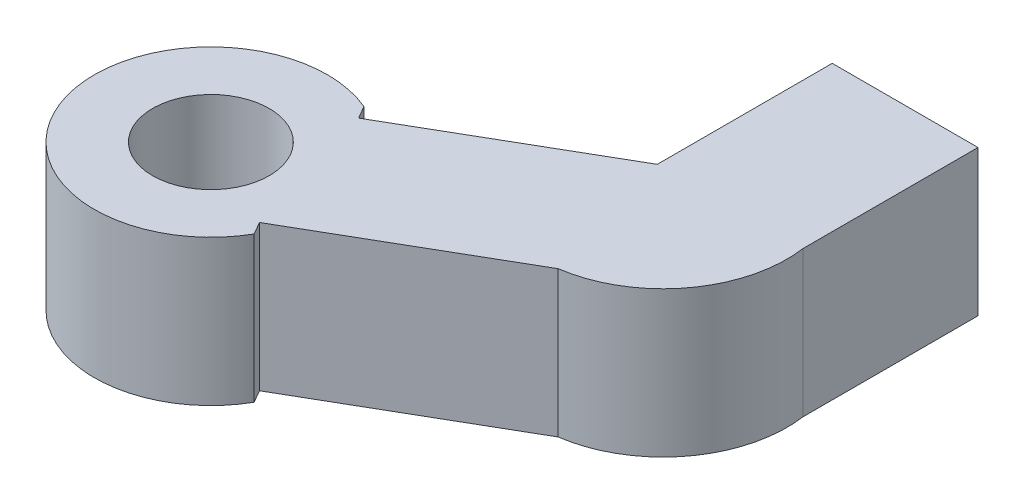
ISO-10303-21;
HEADER;
FILE_DESCRIPTION(('STEP AP214'),'2;1');
FILE_NAME('part.step','',(''),(''),'','','');
FILE_SCHEMA(('AUTOMOTIVE_DESIGN { 1 0 10303 214 1 1 1 1 }'));
ENDSEC;
DATA;
#1=APPLICATION_CONTEXT('core data for automotive mechanical design processes');
#2=APPLICATION_PROTOCOL_DEFINITION('international standard','automotive_design',2000,#1);
#3=PRODUCT_CONTEXT('',#1,'mechanical');
#4=PRODUCT('Part','Part','',(#3));
#5=PRODUCT_RELATED_PRODUCT_CATEGORY('part','',(#4));
#6=PRODUCT_DEFINITION_FORMATION('','',#4);
#7=PRODUCT_DEFINITION_CONTEXT('part definition',#1,'design');
#8=PRODUCT_DEFINITION('design','',#6,#7);
#9=PRODUCT_DEFINITION_SHAPE('','',#8);
#10=(LENGTH_UNIT() NAMED_UNIT(*) SI_UNIT(.MILLI.,.METRE.));
#11=(NAMED_UNIT(*) PLANE_ANGLE_UNIT() SI_UNIT($,.RADIAN.));
#12=(NAMED_UNIT(*) SI_UNIT($,.STERADIAN.) SOLID_ANGLE_UNIT());
#13=UNCERTAINTY_MEASURE_WITH_UNIT(LENGTH_MEASURE(1.E-05),#10,'distance_accuracy_value','');
#14=(GEOMETRIC_REPRESENTATION_CONTEXT(3) GLOBAL_UNCERTAINTY_ASSIGNED_CONTEXT((#13)) GLOBAL_UNIT_ASSIGNED_CONTEXT((#10,
#11,#12)) REPRESENTATION_CONTEXT('',''));
#15=CARTESIAN_POINT('',(0.,0.,0.));
#16=DIRECTION('',(0.,0.,1.));
#17=DIRECTION('',(1.,0.,0.));
#18=AXIS2_PLACEMENT_3D('',#15,#16,#17);
#19=CARTESIAN_POINT('',(0.791681084241543,2.5,0.593760813181156));
#20=DIRECTION('',(0.,1.,0.));
#21=DIRECTION('',(0.,0.,1.));
#22=AXIS2_PLACEMENT_3D('',#19,#20,#21);
#23=PLANE('',#22);
#24=DIRECTION('',(0.,0.,1.));
#25=VECTOR('',#24,1.);
#26=CARTESIAN_POINT('',(0.,2.5,0.));
#27=LINE('',#26,#25);
#28=CARTESIAN_POINT('',(0.,2.5,-6.));
#29=VERTEX_POINT('',#28);
#30=CARTESIAN_POINT('',(0.,2.5,0.));
#31=VERTEX_POINT('',#30);
#32=EDGE_CURVE('E177',#29,#31,#27,.T.);
#33=ORIENTED_EDGE('',*,*,#32,.T.);
#34=DIRECTION('',(-0.866025403784436,0.,0.500000000000004));
#35=VECTOR('',#34,1.);
#36=CARTESIAN_POINT('',(0.,2.5,0.));
#37=LINE('',#36,#35);
#38=CARTESIAN_POINT('',(-6.49519052838327,2.5,3.75000000000003));
#39=VERTEX_POINT('',#38);
#40=EDGE_CURVE('E107',#31,#39,#37,.T.);
#41=ORIENTED_EDGE('',*,*,#40,.T.);
#42=DIRECTION('',(-0.500000000000004,0.,-0.866025403784437));
#43=VECTOR('',#42,1.);
#44=CARTESIAN_POINT('',(-6.49519052838327,2.5,3.75000000000003));
#45=LINE('',#44,#43);
#46=CARTESIAN_POINT('',(-6.74519052838327,2.5,3.31698729810781));
#47=VERTEX_POINT('',#46);
#48=EDGE_CURVE('E202',#39,#47,#45,.T.);
#49=ORIENTED_EDGE('',*,*,#48,.T.);
#50=CARTESIAN_POINT('',(-8.31644795723708,2.5,6.99545846046205));
#51=DIRECTION('',(0.,1.,0.));
#52=DIRECTION('',(0.,0.,1.));
#53=AXIS2_PLACEMENT_3D('',#50,#51,#52);
#54=CIRCLE('',#53,4.);
#55=CARTESIAN_POINT('',(-4.84519052838327,2.5,8.98301270189225));
#56=VERTEX_POINT('',#55);
#57=EDGE_CURVE('E220',#47,#56,#54,.T.);
#58=ORIENTED_EDGE('',*,*,#57,.T.);
#59=DIRECTION('',(-0.500000000000003,0.,-0.866025403784437));
#60=VECTOR('',#59,1.);
#61=CARTESIAN_POINT('',(-5.09519052838327,2.5,8.55000000000003));
#62=LINE('',#61,#60);
#63=CARTESIAN_POINT('',(-5.09519052838327,2.5,8.55000000000003));
#64=VERTEX_POINT('',#63);
#65=EDGE_CURVE('E218',#56,#64,#62,.T.);
#66=ORIENTED_EDGE('',*,*,#65,.T.);
#67=DIRECTION('',(0.866025403784437,0.,-0.500000000000004));
#68=VECTOR('',#67,1.);
#69=CARTESIAN_POINT('',(1.40000000000002,2.5,4.8));
#70=LINE('',#69,#68);
#71=CARTESIAN_POINT('',(1.40000000000002,2.5,4.8));
#72=VERTEX_POINT('',#71);
#73=EDGE_CURVE('E129',#64,#72,#70,.T.);
#74=ORIENTED_EDGE('',*,*,#73,.T.);
#75=CARTESIAN_POINT('',(0.791681084241543,2.5,0.593760813181156));
#76=DIRECTION('',(0.,1.,0.));
#77=DIRECTION('',(0.,0.,1.));
#78=AXIS2_PLACEMENT_3D('',#75,#76,#77);
#79=CIRCLE('',#78,4.25);
#80=CARTESIAN_POINT('',(5.,2.5,0.));
#81=VERTEX_POINT('',#80);
#82=EDGE_CURVE('E123',#72,#81,#79,.T.);
#83=ORIENTED_EDGE('',*,*,#82,.T.);
#84=DIRECTION('',(0.,0.,-1.));
#85=VECTOR('',#84,1.);
#86=CARTESIAN_POINT('',(5.,2.5,0.));
#87=LINE('',#86,#85);
#88=CARTESIAN_POINT('',(5.,2.5,-6.));
#89=VERTEX_POINT('',#88);
#90=EDGE_CURVE('E127',#81,#89,#87,.T.);
#91=ORIENTED_EDGE('',*,*,#90,.T.);
#92=DIRECTION('',(-1.,0.,0.));
#93=VECTOR('',#92,1.);
#94=CARTESIAN_POINT('',(0.,2.5,-6.));
#95=LINE('',#94,#93);
#96=EDGE_CURVE('E61',#89,#29,#95,.T.);
#97=ORIENTED_EDGE('',*,*,#96,.T.);
#98=EDGE_LOOP('',(#33,#41,#49,#58,#66,#74,#83,#91,#97));
#99=FACE_BOUND('',#98,.T.);
#100=CARTESIAN_POINT('',(-8.31644795723708,2.5,6.99545846046205));
#101=DIRECTION('',(0.,1.,0.));
#102=DIRECTION('',(0.,0.,1.));
#103=AXIS2_PLACEMENT_3D('',#100,#101,#102);
#104=CIRCLE('',#103,2.);
#105=CARTESIAN_POINT('',(-8.31644795723708,2.5,8.99545846046205));
#106=VERTEX_POINT('',#105);
#107=EDGE_CURVE('E156',#106,#106,#104,.T.);
#108=ORIENTED_EDGE('',*,*,#107,.F.);
#109=EDGE_LOOP('',(#108));
#110=FACE_BOUND('',#109,.T.);
#111=ADVANCED_FACE('F43',(#99,#110),#23,.T.);
#112=CARTESIAN_POINT('',(0.791681084241543,-2.5,0.593760813181156));
#113=DIRECTION('',(0.,1.,0.));
#114=DIRECTION('',(0.,0.,1.));
#115=AXIS2_PLACEMENT_3D('',#112,#113,#114);
#116=PLANE('',#115);
#117=DIRECTION('',(0.,0.,1.));
#118=VECTOR('',#117,1.);
#119=CARTESIAN_POINT('',(0.,-2.5,0.));
#120=LINE('',#119,#118);
#121=CARTESIAN_POINT('',(0.,-2.5,-6.));
#122=VERTEX_POINT('',#121);
#123=CARTESIAN_POINT('',(0.,-2.5,0.));
#124=VERTEX_POINT('',#123);
#125=EDGE_CURVE('E151',#122,#124,#120,.T.);
#126=ORIENTED_EDGE('',*,*,#125,.F.);
#127=DIRECTION('',(-1.,0.,0.));
#128=VECTOR('',#127,1.);
#129=CARTESIAN_POINT('',(0.,-2.5,-6.));
#130=LINE('',#129,#128);
#131=CARTESIAN_POINT('',(5.,-2.5,-6.));
#132=VERTEX_POINT('',#131);
#133=EDGE_CURVE('E99',#132,#122,#130,.T.);
#134=ORIENTED_EDGE('',*,*,#133,.F.);
#135=DIRECTION('',(0.,0.,-1.));
#136=VECTOR('',#135,1.);
#137=CARTESIAN_POINT('',(5.,-2.5,0.));
#138=LINE('',#137,#136);
#139=CARTESIAN_POINT('',(5.,-2.5,0.));
#140=VERTEX_POINT('',#139);
#141=EDGE_CURVE('E93',#140,#132,#138,.T.);
#142=ORIENTED_EDGE('',*,*,#141,.F.);
#143=CARTESIAN_POINT('',(0.791681084241543,-2.5,0.593760813181156));
#144=DIRECTION('',(0.,1.,0.));
#145=DIRECTION('',(0.,0.,1.));
#146=AXIS2_PLACEMENT_3D('',#143,#144,#145);
#147=CIRCLE('',#146,4.25);
#148=CARTESIAN_POINT('',(1.40000000000002,-2.5,4.8));
#149=VERTEX_POINT('',#148);
#150=EDGE_CURVE('E138',#149,#140,#147,.T.);
#151=ORIENTED_EDGE('',*,*,#150,.F.);
#152=DIRECTION('',(0.866025403784437,0.,-0.500000000000004));
#153=VECTOR('',#152,1.);
#154=CARTESIAN_POINT('',(1.40000000000002,-2.5,4.8));
#155=LINE('',#154,#153);
#156=CARTESIAN_POINT('',(-5.09519052838327,-2.5,8.55000000000003));
#157=VERTEX_POINT('',#156);
#158=EDGE_CURVE('E168',#157,#149,#155,.T.);
#159=ORIENTED_EDGE('',*,*,#158,.F.);
#160=DIRECTION('',(-0.500000000000003,0.,-0.866025403784437));
#161=VECTOR('',#160,1.);
#162=CARTESIAN_POINT('',(-5.09519052838327,-2.5,8.55000000000003));
#163=LINE('',#162,#161);
#164=CARTESIAN_POINT('',(-4.84519052838327,-2.5,8.98301270189225));
#165=VERTEX_POINT('',#164);
#166=EDGE_CURVE('E165',#165,#157,#163,.T.);
#167=ORIENTED_EDGE('',*,*,#166,.F.);
#168=CARTESIAN_POINT('',(-8.31644795723708,-2.5,6.99545846046205));
#169=DIRECTION('',(0.,1.,0.));
#170=DIRECTION('',(0.,0.,1.));
#171=AXIS2_PLACEMENT_3D('',#168,#169,#170);
#172=CIRCLE('',#171,4.);
#173=CARTESIAN_POINT('',(-6.74519052838327,-2.5,3.31698729810781));
#174=VERTEX_POINT('',#173);
#175=EDGE_CURVE('E162',#174,#165,#172,.T.);
#176=ORIENTED_EDGE('',*,*,#175,.F.);
#177=DIRECTION('',(-0.500000000000004,0.,-0.866025403784437));
#178=VECTOR('',#177,1.);
#179=CARTESIAN_POINT('',(-6.49519052838327,-2.5,3.75000000000003));
#180=LINE('',#179,#178);
#181=CARTESIAN_POINT('',(-6.49519052838327,-2.5,3.75000000000003));
#182=VERTEX_POINT('',#181);
#183=EDGE_CURVE('E159',#182,#174,#180,.T.);
#184=ORIENTED_EDGE('',*,*,#183,.F.);
#185=DIRECTION('',(-0.866025403784436,0.,0.500000000000004));
#186=VECTOR('',#185,1.);
#187=CARTESIAN_POINT('',(0.,-2.5,0.));
#188=LINE('',#187,#186);
#189=EDGE_CURVE('E155',#124,#182,#188,.T.);
#190=ORIENTED_EDGE('',*,*,#189,.F.);
#191=EDGE_LOOP('',(#126,#134,#142,#151,#159,#167,#176,#184,#190));
#192=FACE_BOUND('',#191,.T.);
#193=CARTESIAN_POINT('',(-8.31644795723708,-2.5,6.99545846046205));
#194=DIRECTION('',(0.,1.,0.));
#195=DIRECTION('',(0.,0.,1.));
#196=AXIS2_PLACEMENT_3D('',#193,#194,#195);
#197=CIRCLE('',#196,2.);
#198=CARTESIAN_POINT('',(-8.31644795723708,-2.5,8.99545846046205));
#199=VERTEX_POINT('',#198);
#200=EDGE_CURVE('E232',#199,#199,#197,.T.);
#201=ORIENTED_EDGE('',*,*,#200,.T.);
#202=EDGE_LOOP('',(#201));
#203=FACE_BOUND('',#202,.T.);
#204=ADVANCED_FACE('F206',(#192,#203),#116,.F.);
#205=CARTESIAN_POINT('',(0.,2.5,0.));
#206=DIRECTION('',(1.,0.,0.));
#207=DIRECTION('',(0.,0.,-1.));
#208=AXIS2_PLACEMENT_3D('',#205,#206,#207);
#209=PLANE('',#208);
#210=ORIENTED_EDGE('',*,*,#125,.T.);
#211=DIRECTION('',(0.,-1.,0.));
#212=VECTOR('',#211,1.);
#213=CARTESIAN_POINT('',(0.,2.5,0.));
#214=LINE('',#213,#212);
#215=EDGE_CURVE('E11',#31,#124,#214,.T.);
#216=ORIENTED_EDGE('',*,*,#215,.F.);
#217=ORIENTED_EDGE('',*,*,#32,.F.);
#218=DIRECTION('',(0.,-1.,0.));
#219=VECTOR('',#218,1.);
#220=CARTESIAN_POINT('',(0.,2.5,-6.));
#221=LINE('',#220,#219);
#222=EDGE_CURVE('E147',#29,#122,#221,.T.);
#223=ORIENTED_EDGE('',*,*,#222,.T.);
#224=EDGE_LOOP('',(#210,#216,#217,#223));
#225=FACE_BOUND('',#224,.T.);
#226=ADVANCED_FACE('F45',(#225),#209,.F.);
#227=CARTESIAN_POINT('',(0.,2.5,0.));
#228=DIRECTION('',(0.500000000000004,0.,0.866025403784436));
#229=DIRECTION('',(0.866025403784436,0.,-0.500000000000004));
#230=AXIS2_PLACEMENT_3D('',#227,#228,#229);
#231=PLANE('',#230);
#232=ORIENTED_EDGE('',*,*,#189,.T.);
#233=DIRECTION('',(0.,-1.,0.));
#234=VECTOR('',#233,1.);
#235=CARTESIAN_POINT('',(-6.49519052838327,2.5,3.75000000000003));
#236=LINE('',#235,#234);
#237=EDGE_CURVE('E53',#39,#182,#236,.T.);
#238=ORIENTED_EDGE('',*,*,#237,.F.);
#239=ORIENTED_EDGE('',*,*,#40,.F.);
#240=ORIENTED_EDGE('',*,*,#215,.T.);
#241=EDGE_LOOP('',(#232,#238,#239,#240));
#242=FACE_BOUND('',#241,.T.);
#243=ADVANCED_FACE('F266',(#242),#231,.F.);
#244=CARTESIAN_POINT('',(-6.49519052838327,2.5,3.75000000000003));
#245=DIRECTION('',(-0.866025403784437,0.,0.500000000000004));
#246=DIRECTION('',(0.500000000000004,0.,0.866025403784437));
#247=AXIS2_PLACEMENT_3D('',#244,#245,#246);
#248=PLANE('',#247);
#249=ORIENTED_EDGE('',*,*,#183,.T.);
#250=DIRECTION('',(0.,-1.,0.));
#251=VECTOR('',#250,1.);
#252=CARTESIAN_POINT('',(-6.74519052838327,2.5,3.31698729810781));
#253=LINE('',#252,#251);
#254=EDGE_CURVE('E192',#47,#174,#253,.T.);
#255=ORIENTED_EDGE('',*,*,#254,.F.);
#256=ORIENTED_EDGE('',*,*,#48,.F.);
#257=ORIENTED_EDGE('',*,*,#237,.T.);
#258=EDGE_LOOP('',(#249,#255,#256,#257));
#259=FACE_BOUND('',#258,.T.);
#260=ADVANCED_FACE('F200',(#259),#248,.F.);
#261=CARTESIAN_POINT('',(-8.31644795723708,2.5,6.99545846046205));
#262=DIRECTION('',(0.,-1.,0.));
#263=DIRECTION('',(0.,0.,-1.));
#264=AXIS2_PLACEMENT_3D('',#261,#262,#263);
#265=CYLINDRICAL_SURFACE('',#264,4.);
#266=ORIENTED_EDGE('',*,*,#175,.T.);
#267=DIRECTION('',(0.,-1.,0.));
#268=VECTOR('',#267,1.);
#269=CARTESIAN_POINT('',(-4.84519052838327,2.5,8.98301270189225));
#270=LINE('',#269,#268);
#271=EDGE_CURVE('E188',#56,#165,#270,.T.);
#272=ORIENTED_EDGE('',*,*,#271,.F.);
#273=ORIENTED_EDGE('',*,*,#57,.F.);
#274=ORIENTED_EDGE('',*,*,#254,.T.);
#275=EDGE_LOOP('',(#266,#272,#273,#274));
#276=FACE_BOUND('',#275,.T.);
#277=ADVANCED_FACE('F212',(#276),#265,.T.);
#278=CARTESIAN_POINT('',(-5.09519052838327,2.5,8.55000000000003));
#279=DIRECTION('',(-0.866025403784437,0.,0.500000000000003));
#280=DIRECTION('',(0.500000000000003,0.,0.866025403784437));
#281=AXIS2_PLACEMENT_3D('',#278,#279,#280);
#282=PLANE('',#281);
#283=ORIENTED_EDGE('',*,*,#166,.T.);
#284=DIRECTION('',(0.,-1.,0.));
#285=VECTOR('',#284,1.);
#286=CARTESIAN_POINT('',(-5.09519052838327,2.5,8.55000000000003));
#287=LINE('',#286,#285);
#288=EDGE_CURVE('E184',#64,#157,#287,.T.);
#289=ORIENTED_EDGE('',*,*,#288,.F.);
#290=ORIENTED_EDGE('',*,*,#65,.F.);
#291=ORIENTED_EDGE('',*,*,#271,.T.);
#292=EDGE_LOOP('',(#283,#289,#290,#291));
#293=FACE_BOUND('',#292,.T.);
#294=ADVANCED_FACE('F216',(#293),#282,.F.);
#295=CARTESIAN_POINT('',(1.40000000000002,2.5,4.8));
#296=DIRECTION('',(-0.500000000000004,0.,-0.866025403784437));
#297=DIRECTION('',(-0.866025403784437,0.,0.500000000000004));
#298=AXIS2_PLACEMENT_3D('',#295,#296,#297);
#299=PLANE('',#298);
#300=ORIENTED_EDGE('',*,*,#158,.T.);
#301=DIRECTION('',(0.,-1.,0.));
#302=VECTOR('',#301,1.);
#303=CARTESIAN_POINT('',(1.40000000000002,2.5,4.8));
#304=LINE('',#303,#302);
#305=EDGE_CURVE('E140',#72,#149,#304,.T.);
#306=ORIENTED_EDGE('',*,*,#305,.F.);
#307=ORIENTED_EDGE('',*,*,#73,.F.);
#308=ORIENTED_EDGE('',*,*,#288,.T.);
#309=EDGE_LOOP('',(#300,#306,#307,#308));
#310=FACE_BOUND('',#309,.T.);
#311=ADVANCED_FACE('F257',(#310),#299,.F.);
#312=CARTESIAN_POINT('',(0.791681084241543,2.5,0.593760813181156));
#313=DIRECTION('',(0.,-1.,0.));
#314=DIRECTION('',(0.,0.,-1.));
#315=AXIS2_PLACEMENT_3D('',#312,#313,#314);
#316=CYLINDRICAL_SURFACE('',#315,4.25);
#317=ORIENTED_EDGE('',*,*,#150,.T.);
#318=DIRECTION('',(0.,-1.,0.));
#319=VECTOR('',#318,1.);
#320=CARTESIAN_POINT('',(5.,2.5,0.));
#321=LINE('',#320,#319);
#322=EDGE_CURVE('E135',#81,#140,#321,.T.);
#323=ORIENTED_EDGE('',*,*,#322,.F.);
#324=ORIENTED_EDGE('',*,*,#82,.F.);
#325=ORIENTED_EDGE('',*,*,#305,.T.);
#326=EDGE_LOOP('',(#317,#323,#324,#325));
#327=FACE_BOUND('',#326,.T.);
#328=ADVANCED_FACE('F136',(#327),#316,.T.);
#329=CARTESIAN_POINT('',(5.,2.5,0.));
#330=DIRECTION('',(-1.,0.,0.));
#331=DIRECTION('',(0.,0.,1.));
#332=AXIS2_PLACEMENT_3D('',#329,#330,#331);
#333=PLANE('',#332);
#334=ORIENTED_EDGE('',*,*,#141,.T.);
#335=DIRECTION('',(0.,-1.,0.));
#336=VECTOR('',#335,1.);
#337=CARTESIAN_POINT('',(5.,2.5,-6.));
#338=LINE('',#337,#336);
#339=EDGE_CURVE('E141',#89,#132,#338,.T.);
#340=ORIENTED_EDGE('',*,*,#339,.F.);
#341=ORIENTED_EDGE('',*,*,#90,.F.);
#342=ORIENTED_EDGE('',*,*,#322,.T.);
#343=EDGE_LOOP('',(#334,#340,#341,#342));
#344=FACE_BOUND('',#343,.T.);
#345=ADVANCED_FACE('F143',(#344),#333,.F.);
#346=CARTESIAN_POINT('',(0.,2.5,-6.));
#347=DIRECTION('',(0.,0.,1.));
#348=DIRECTION('',(1.,0.,0.));
#349=AXIS2_PLACEMENT_3D('',#346,#347,#348);
#350=PLANE('',#349);
#351=ORIENTED_EDGE('',*,*,#133,.T.);
#352=ORIENTED_EDGE('',*,*,#222,.F.);
#353=ORIENTED_EDGE('',*,*,#96,.F.);
#354=ORIENTED_EDGE('',*,*,#339,.T.);
#355=EDGE_LOOP('',(#351,#352,#353,#354));
#356=FACE_BOUND('',#355,.T.);
#357=ADVANCED_FACE('F250',(#356),#350,.F.);
#358=CARTESIAN_POINT('',(-8.31644795723708,2.5,6.99545846046205));
#359=DIRECTION('',(0.,-1.,0.));
#360=DIRECTION('',(0.,0.,-1.));
#361=AXIS2_PLACEMENT_3D('',#358,#359,#360);
#362=CYLINDRICAL_SURFACE('',#361,2.);
#363=ORIENTED_EDGE('',*,*,#107,.T.);
#364=EDGE_LOOP('',(#363));
#365=FACE_BOUND('',#364,.T.);
#366=ORIENTED_EDGE('',*,*,#200,.F.);
#367=EDGE_LOOP('',(#366));
#368=FACE_BOUND('',#367,.T.);
#369=ADVANCED_FACE('F240',(#365,#368),#362,.F.);
#370=CLOSED_SHELL('',(#111,#204,#226,#243,#260,#277,#294,#311,#328,#345,#357,#369));
#371=MANIFOLD_SOLID_BREP('B2',#370);
#372=ADVANCED_BREP_SHAPE_REPRESENTATION('',(#18,#371),#14);
#373=SHAPE_DEFINITION_REPRESENTATION(#9,#372);
ENDSEC;
END-ISO-10303-21;
